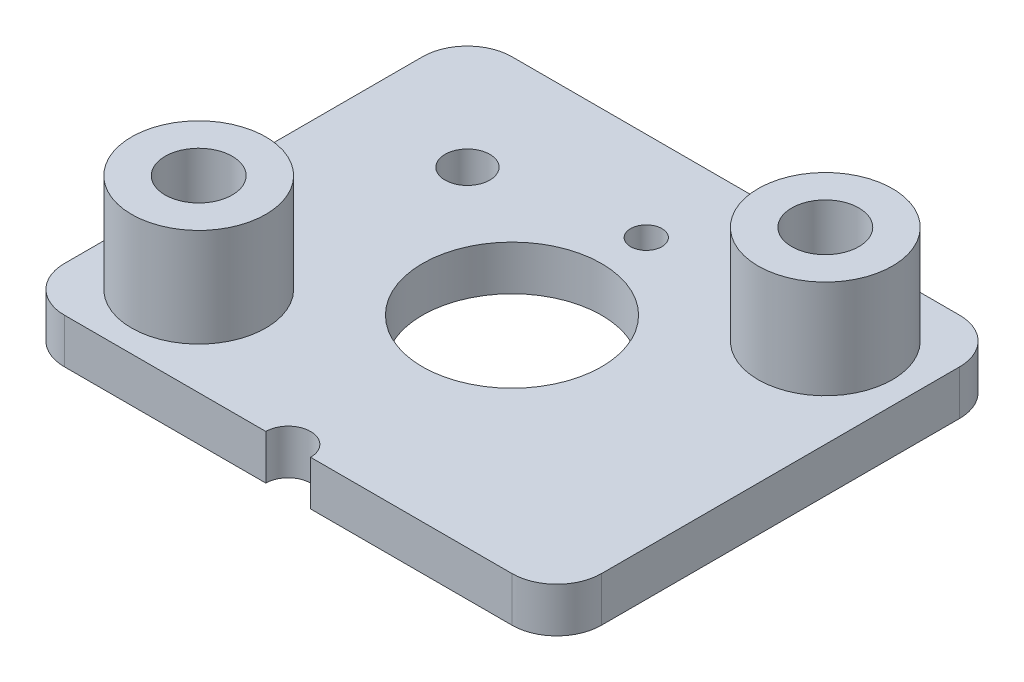
ISO-10303-21;
HEADER;
FILE_DESCRIPTION(('STEP AP214'),'2;1');
FILE_NAME('part.step','',(''),(''),'','','');
FILE_SCHEMA(('AUTOMOTIVE_DESIGN { 1 0 10303 214 1 1 1 1 }'));
ENDSEC;
DATA;
#1=APPLICATION_CONTEXT('core data for automotive mechanical design processes');
#2=APPLICATION_PROTOCOL_DEFINITION('international standard','automotive_design',2000,#1);
#3=PRODUCT_CONTEXT('',#1,'mechanical');
#4=PRODUCT('Part','Part','',(#3));
#5=PRODUCT_RELATED_PRODUCT_CATEGORY('part','',(#4));
#6=PRODUCT_DEFINITION_FORMATION('','',#4);
#7=PRODUCT_DEFINITION_CONTEXT('part definition',#1,'design');
#8=PRODUCT_DEFINITION('design','',#6,#7);
#9=PRODUCT_DEFINITION_SHAPE('','',#8);
#10=(LENGTH_UNIT() NAMED_UNIT(*) SI_UNIT(.MILLI.,.METRE.));
#11=(NAMED_UNIT(*) PLANE_ANGLE_UNIT() SI_UNIT($,.RADIAN.));
#12=(NAMED_UNIT(*) SI_UNIT($,.STERADIAN.) SOLID_ANGLE_UNIT());
#13=UNCERTAINTY_MEASURE_WITH_UNIT(LENGTH_MEASURE(1.E-05),#10,'distance_accuracy_value','');
#14=(GEOMETRIC_REPRESENTATION_CONTEXT(3) GLOBAL_UNCERTAINTY_ASSIGNED_CONTEXT((#13)) GLOBAL_UNIT_ASSIGNED_CONTEXT((#10,
#11,#12)) REPRESENTATION_CONTEXT('',''));
#15=CARTESIAN_POINT('',(0.,0.,0.));
#16=DIRECTION('',(0.,0.,1.));
#17=DIRECTION('',(1.,0.,0.));
#18=AXIS2_PLACEMENT_3D('',#15,#16,#17);
#19=CARTESIAN_POINT('',(-4.,3.2,3.));
#20=DIRECTION('',(0.,-1.,0.));
#21=DIRECTION('',(0.,0.,-1.));
#22=AXIS2_PLACEMENT_3D('',#19,#20,#21);
#23=CYLINDRICAL_SURFACE('',#22,1.5);
#24=CARTESIAN_POINT('',(-4.,3.2,3.));
#25=DIRECTION('',(0.,1.,0.));
#26=DIRECTION('',(0.,0.,1.));
#27=AXIS2_PLACEMENT_3D('',#24,#25,#26);
#28=CIRCLE('',#27,1.5);
#29=CARTESIAN_POINT('',(-4.,3.2,4.5));
#30=VERTEX_POINT('',#29);
#31=EDGE_CURVE('E11',#30,#30,#28,.T.);
#32=ORIENTED_EDGE('',*,*,#31,.F.);
#33=EDGE_LOOP('',(#32));
#34=FACE_BOUND('',#33,.T.);
#35=CARTESIAN_POINT('',(-4.,1.,3.));
#36=DIRECTION('',(0.,1.,0.));
#37=DIRECTION('',(0.,0.,1.));
#38=AXIS2_PLACEMENT_3D('',#35,#36,#37);
#39=CIRCLE('',#38,1.5);
#40=CARTESIAN_POINT('',(-4.,1.,4.5));
#41=VERTEX_POINT('',#40);
#42=EDGE_CURVE('E48',#41,#41,#39,.T.);
#43=ORIENTED_EDGE('',*,*,#42,.T.);
#44=EDGE_LOOP('',(#43));
#45=FACE_BOUND('',#44,.T.);
#46=ADVANCED_FACE('F45',(#34,#45),#23,.T.);
#47=CARTESIAN_POINT('',(-4.,3.2,3.));
#48=DIRECTION('',(0.,1.,0.));
#49=DIRECTION('',(0.,0.,1.));
#50=AXIS2_PLACEMENT_3D('',#47,#48,#49);
#51=PLANE('',#50);
#52=CARTESIAN_POINT('',(-4.,3.2,3.));
#53=DIRECTION('',(0.,1.,0.));
#54=DIRECTION('',(0.,0.,1.));
#55=AXIS2_PLACEMENT_3D('',#52,#53,#54);
#56=CIRCLE('',#55,0.75);
#57=CARTESIAN_POINT('',(-4.,3.2,3.75));
#58=VERTEX_POINT('',#57);
#59=EDGE_CURVE('E57',#58,#58,#56,.T.);
#60=ORIENTED_EDGE('',*,*,#59,.F.);
#61=EDGE_LOOP('',(#60));
#62=FACE_BOUND('',#61,.T.);
#63=ORIENTED_EDGE('',*,*,#31,.T.);
#64=EDGE_LOOP('',(#63));
#65=FACE_BOUND('',#64,.T.);
#66=ADVANCED_FACE('F72',(#62,#65),#51,.T.);
#67=CARTESIAN_POINT('',(-4.,1.,3.));
#68=DIRECTION('',(0.,1.,0.));
#69=DIRECTION('',(0.,0.,1.));
#70=AXIS2_PLACEMENT_3D('',#67,#68,#69);
#71=PLANE('',#70);
#72=CARTESIAN_POINT('',(-4.,1.,3.));
#73=DIRECTION('',(0.,1.,0.));
#74=DIRECTION('',(0.,0.,1.));
#75=AXIS2_PLACEMENT_3D('',#72,#73,#74);
#76=CIRCLE('',#75,0.75);
#77=CARTESIAN_POINT('',(-4.,1.,3.75));
#78=VERTEX_POINT('',#77);
#79=EDGE_CURVE('E55',#78,#78,#76,.T.);
#80=ORIENTED_EDGE('',*,*,#79,.T.);
#81=EDGE_LOOP('',(#80));
#82=FACE_BOUND('',#81,.T.);
#83=ORIENTED_EDGE('',*,*,#42,.F.);
#84=EDGE_LOOP('',(#83));
#85=FACE_BOUND('',#84,.T.);
#86=ADVANCED_FACE('F63',(#82,#85),#71,.F.);
#87=CARTESIAN_POINT('',(-4.,1.,3.));
#88=DIRECTION('',(0.,1.,0.));
#89=DIRECTION('',(0.,0.,1.));
#90=AXIS2_PLACEMENT_3D('',#87,#88,#89);
#91=CYLINDRICAL_SURFACE('',#90,0.75);
#92=ORIENTED_EDGE('',*,*,#79,.F.);
#93=EDGE_LOOP('',(#92));
#94=FACE_BOUND('',#93,.T.);
#95=ORIENTED_EDGE('',*,*,#59,.T.);
#96=EDGE_LOOP('',(#95));
#97=FACE_BOUND('',#96,.T.);
#98=ADVANCED_FACE('F66',(#94,#97),#91,.F.);
#99=CLOSED_SHELL('',(#46,#66,#86,#98));
#100=MANIFOLD_SOLID_BREP('B2',#99);
#101=CARTESIAN_POINT('',(4.,3.2,-3.));
#102=DIRECTION('',(0.,-1.,0.));
#103=DIRECTION('',(0.,0.,-1.));
#104=AXIS2_PLACEMENT_3D('',#101,#102,#103);
#105=CYLINDRICAL_SURFACE('',#104,1.5);
#106=CARTESIAN_POINT('',(4.,3.2,-3.));
#107=DIRECTION('',(0.,1.,0.));
#108=DIRECTION('',(0.,0.,1.));
#109=AXIS2_PLACEMENT_3D('',#106,#107,#108);
#110=CIRCLE('',#109,1.5);
#111=CARTESIAN_POINT('',(4.,3.2,-1.5));
#112=VERTEX_POINT('',#111);
#113=EDGE_CURVE('E44',#112,#112,#110,.T.);
#114=ORIENTED_EDGE('',*,*,#113,.F.);
#115=EDGE_LOOP('',(#114));
#116=FACE_BOUND('',#115,.T.);
#117=CARTESIAN_POINT('',(4.,1.,-3.));
#118=DIRECTION('',(0.,1.,0.));
#119=DIRECTION('',(0.,0.,1.));
#120=AXIS2_PLACEMENT_3D('',#117,#118,#119);
#121=CIRCLE('',#120,1.5);
#122=CARTESIAN_POINT('',(4.,1.,-1.5));
#123=VERTEX_POINT('',#122);
#124=EDGE_CURVE('E118',#123,#123,#121,.T.);
#125=ORIENTED_EDGE('',*,*,#124,.T.);
#126=EDGE_LOOP('',(#125));
#127=FACE_BOUND('',#126,.T.);
#128=ADVANCED_FACE('F115',(#116,#127),#105,.T.);
#129=CARTESIAN_POINT('',(4.,3.2,-3.));
#130=DIRECTION('',(0.,1.,0.));
#131=DIRECTION('',(0.,0.,1.));
#132=AXIS2_PLACEMENT_3D('',#129,#130,#131);
#133=PLANE('',#132);
#134=CARTESIAN_POINT('',(4.,3.2,-3.));
#135=DIRECTION('',(0.,1.,0.));
#136=DIRECTION('',(0.,0.,1.));
#137=AXIS2_PLACEMENT_3D('',#134,#135,#136);
#138=CIRCLE('',#137,0.75);
#139=CARTESIAN_POINT('',(4.,3.2,-2.25));
#140=VERTEX_POINT('',#139);
#141=EDGE_CURVE('E127',#140,#140,#138,.T.);
#142=ORIENTED_EDGE('',*,*,#141,.F.);
#143=EDGE_LOOP('',(#142));
#144=FACE_BOUND('',#143,.T.);
#145=ORIENTED_EDGE('',*,*,#113,.T.);
#146=EDGE_LOOP('',(#145));
#147=FACE_BOUND('',#146,.T.);
#148=ADVANCED_FACE('F142',(#144,#147),#133,.T.);
#149=CARTESIAN_POINT('',(4.,1.,-3.));
#150=DIRECTION('',(0.,1.,0.));
#151=DIRECTION('',(0.,0.,1.));
#152=AXIS2_PLACEMENT_3D('',#149,#150,#151);
#153=PLANE('',#152);
#154=CARTESIAN_POINT('',(4.,1.,-3.));
#155=DIRECTION('',(0.,1.,0.));
#156=DIRECTION('',(0.,0.,1.));
#157=AXIS2_PLACEMENT_3D('',#154,#155,#156);
#158=CIRCLE('',#157,0.75);
#159=CARTESIAN_POINT('',(4.,1.,-2.25));
#160=VERTEX_POINT('',#159);
#161=EDGE_CURVE('E125',#160,#160,#158,.T.);
#162=ORIENTED_EDGE('',*,*,#161,.T.);
#163=EDGE_LOOP('',(#162));
#164=FACE_BOUND('',#163,.T.);
#165=ORIENTED_EDGE('',*,*,#124,.F.);
#166=EDGE_LOOP('',(#165));
#167=FACE_BOUND('',#166,.T.);
#168=ADVANCED_FACE('F133',(#164,#167),#153,.F.);
#169=CARTESIAN_POINT('',(4.,1.,-3.));
#170=DIRECTION('',(0.,1.,0.));
#171=DIRECTION('',(0.,0.,1.));
#172=AXIS2_PLACEMENT_3D('',#169,#170,#171);
#173=CYLINDRICAL_SURFACE('',#172,0.75);
#174=ORIENTED_EDGE('',*,*,#161,.F.);
#175=EDGE_LOOP('',(#174));
#176=FACE_BOUND('',#175,.T.);
#177=ORIENTED_EDGE('',*,*,#141,.T.);
#178=EDGE_LOOP('',(#177));
#179=FACE_BOUND('',#178,.T.);
#180=ADVANCED_FACE('F136',(#176,#179),#173,.F.);
#181=CLOSED_SHELL('',(#128,#148,#168,#180));
#182=MANIFOLD_SOLID_BREP('B6',#181);
#183=CARTESIAN_POINT('',(0.,1.,5.));
#184=DIRECTION('',(0.,-1.,0.));
#185=DIRECTION('',(0.,0.,-1.));
#186=AXIS2_PLACEMENT_3D('',#183,#184,#185);
#187=PLANE('',#186);
#188=DIRECTION('',(0.,0.,1.));
#189=VECTOR('',#188,1.);
#190=CARTESIAN_POINT('',(-6.,1.,-5.));
#191=LINE('',#190,#189);
#192=CARTESIAN_POINT('',(-6.,1.,-4.));
#193=VERTEX_POINT('',#192);
#194=CARTESIAN_POINT('',(-6.,1.,4.));
#195=VERTEX_POINT('',#194);
#196=EDGE_CURVE('E265',#193,#195,#191,.T.);
#197=ORIENTED_EDGE('',*,*,#196,.T.);
#198=CARTESIAN_POINT('',(-5.,1.,4.));
#199=DIRECTION('',(0.,-1.,0.));
#200=DIRECTION('',(0.,0.,-1.));
#201=AXIS2_PLACEMENT_3D('',#198,#199,#200);
#202=CIRCLE('',#201,1.);
#203=CARTESIAN_POINT('',(-5.,1.,5.));
#204=VERTEX_POINT('',#203);
#205=EDGE_CURVE('E261',#195,#204,#202,.F.);
#206=ORIENTED_EDGE('',*,*,#205,.T.);
#207=DIRECTION('',(1.,0.,0.));
#208=VECTOR('',#207,1.);
#209=CARTESIAN_POINT('',(-6.,1.,5.));
#210=LINE('',#209,#208);
#211=CARTESIAN_POINT('',(-0.499999999999999,1.,5.));
#212=VERTEX_POINT('',#211);
#213=EDGE_CURVE('E252',#204,#212,#210,.T.);
#214=ORIENTED_EDGE('',*,*,#213,.T.);
#215=CARTESIAN_POINT('',(0.,1.,5.));
#216=DIRECTION('',(0.,-1.,0.));
#217=DIRECTION('',(0.,0.,-1.));
#218=AXIS2_PLACEMENT_3D('',#215,#216,#217);
#219=CIRCLE('',#218,0.5);
#220=CARTESIAN_POINT('',(0.5,1.,5.));
#221=VERTEX_POINT('',#220);
#222=EDGE_CURVE('E258',#212,#221,#219,.T.);
#223=ORIENTED_EDGE('',*,*,#222,.T.);
#224=DIRECTION('',(1.,0.,0.));
#225=VECTOR('',#224,1.);
#226=CARTESIAN_POINT('',(0.5,1.,5.));
#227=LINE('',#226,#225);
#228=CARTESIAN_POINT('',(5.,1.,5.));
#229=VERTEX_POINT('',#228);
#230=EDGE_CURVE('E298',#221,#229,#227,.T.);
#231=ORIENTED_EDGE('',*,*,#230,.T.);
#232=CARTESIAN_POINT('',(5.,1.,4.));
#233=DIRECTION('',(0.,-1.,0.));
#234=DIRECTION('',(0.,0.,-1.));
#235=AXIS2_PLACEMENT_3D('',#232,#233,#234);
#236=CIRCLE('',#235,1.);
#237=CARTESIAN_POINT('',(6.,1.,4.));
#238=VERTEX_POINT('',#237);
#239=EDGE_CURVE('E314',#229,#238,#236,.F.);
#240=ORIENTED_EDGE('',*,*,#239,.T.);
#241=DIRECTION('',(0.,0.,-1.));
#242=VECTOR('',#241,1.);
#243=CARTESIAN_POINT('',(6.,1.,-5.));
#244=LINE('',#243,#242);
#245=CARTESIAN_POINT('',(6.,1.,-4.));
#246=VERTEX_POINT('',#245);
#247=EDGE_CURVE('E330',#238,#246,#244,.T.);
#248=ORIENTED_EDGE('',*,*,#247,.T.);
#249=CARTESIAN_POINT('',(5.,1.,-4.));
#250=DIRECTION('',(0.,-1.,0.));
#251=DIRECTION('',(0.,0.,-1.));
#252=AXIS2_PLACEMENT_3D('',#249,#250,#251);
#253=CIRCLE('',#252,1.);
#254=CARTESIAN_POINT('',(5.,1.,-5.));
#255=VERTEX_POINT('',#254);
#256=EDGE_CURVE('E198',#246,#255,#253,.F.);
#257=ORIENTED_EDGE('',*,*,#256,.T.);
#258=DIRECTION('',(-1.,0.,0.));
#259=VECTOR('',#258,1.);
#260=CARTESIAN_POINT('',(-6.,1.,-5.));
#261=LINE('',#260,#259);
#262=CARTESIAN_POINT('',(-5.,1.,-5.));
#263=VERTEX_POINT('',#262);
#264=EDGE_CURVE('E335',#255,#263,#261,.T.);
#265=ORIENTED_EDGE('',*,*,#264,.T.);
#266=CARTESIAN_POINT('',(-5.,1.,-4.));
#267=DIRECTION('',(0.,-1.,0.));
#268=DIRECTION('',(0.,0.,-1.));
#269=AXIS2_PLACEMENT_3D('',#266,#267,#268);
#270=CIRCLE('',#269,1.);
#271=EDGE_CURVE('E316',#263,#193,#270,.F.);
#272=ORIENTED_EDGE('',*,*,#271,.T.);
#273=EDGE_LOOP('',(#197,#206,#214,#223,#231,#240,#248,#257,#265,#272));
#274=FACE_BOUND('',#273,.T.);
#275=CARTESIAN_POINT('',(0.,1.,0.));
#276=DIRECTION('',(0.,1.,0.));
#277=DIRECTION('',(0.,0.,1.));
#278=AXIS2_PLACEMENT_3D('',#275,#276,#277);
#279=CIRCLE('',#278,2.);
#280=CARTESIAN_POINT('',(0.,1.,2.));
#281=VERTEX_POINT('',#280);
#282=EDGE_CURVE('E288',#281,#281,#279,.T.);
#283=ORIENTED_EDGE('',*,*,#282,.F.);
#284=EDGE_LOOP('',(#283));
#285=FACE_BOUND('',#284,.T.);
#286=CARTESIAN_POINT('',(4.,1.,-3.));
#287=DIRECTION('',(0.,1.,0.));
#288=DIRECTION('',(0.,0.,1.));
#289=AXIS2_PLACEMENT_3D('',#286,#287,#288);
#290=CIRCLE('',#289,1.5);
#291=CARTESIAN_POINT('',(4.,1.,-1.5));
#292=VERTEX_POINT('',#291);
#293=EDGE_CURVE('E359',#292,#292,#290,.T.);
#294=ORIENTED_EDGE('',*,*,#293,.F.);
#295=EDGE_LOOP('',(#294));
#296=FACE_BOUND('',#295,.T.);
#297=CARTESIAN_POINT('',(0.,1.,-3.));
#298=DIRECTION('',(0.,1.,0.));
#299=DIRECTION('',(0.,0.,1.));
#300=AXIS2_PLACEMENT_3D('',#297,#298,#299);
#301=CIRCLE('',#300,0.35);
#302=CARTESIAN_POINT('',(0.,1.,-2.65));
#303=VERTEX_POINT('',#302);
#304=EDGE_CURVE('E365',#303,#303,#301,.T.);
#305=ORIENTED_EDGE('',*,*,#304,.F.);
#306=EDGE_LOOP('',(#305));
#307=FACE_BOUND('',#306,.T.);
#308=CARTESIAN_POINT('',(-4.,1.,3.));
#309=DIRECTION('',(0.,1.,0.));
#310=DIRECTION('',(0.,0.,1.));
#311=AXIS2_PLACEMENT_3D('',#308,#309,#310);
#312=CIRCLE('',#311,1.5);
#313=CARTESIAN_POINT('',(-4.,1.,4.5));
#314=VERTEX_POINT('',#313);
#315=EDGE_CURVE('E371',#314,#314,#312,.T.);
#316=ORIENTED_EDGE('',*,*,#315,.F.);
#317=EDGE_LOOP('',(#316));
#318=FACE_BOUND('',#317,.T.);
#319=CARTESIAN_POINT('',(-3.3605974754568,1.,-2.36490838925265));
#320=DIRECTION('',(0.,1.,0.));
#321=DIRECTION('',(0.,0.,1.));
#322=AXIS2_PLACEMENT_3D('',#319,#320,#321);
#323=CIRCLE('',#322,0.5);
#324=CARTESIAN_POINT('',(-3.3605974754568,1.,-1.86490838925265));
#325=VERTEX_POINT('',#324);
#326=EDGE_CURVE('E377',#325,#325,#323,.T.);
#327=ORIENTED_EDGE('',*,*,#326,.F.);
#328=EDGE_LOOP('',(#327));
#329=FACE_BOUND('',#328,.T.);
#330=ADVANCED_FACE('F176',(#274,#285,#296,#307,#318,#329),#187,.F.);
#331=CARTESIAN_POINT('',(0.,0.,5.));
#332=DIRECTION('',(0.,-1.,0.));
#333=DIRECTION('',(0.,0.,-1.));
#334=AXIS2_PLACEMENT_3D('',#331,#332,#333);
#335=PLANE('',#334);
#336=CARTESIAN_POINT('',(-4.,0.,3.));
#337=DIRECTION('',(0.,1.,0.));
#338=DIRECTION('',(0.,0.,1.));
#339=AXIS2_PLACEMENT_3D('',#336,#337,#338);
#340=CIRCLE('',#339,1.5);
#341=CARTESIAN_POINT('',(-4.,0.,4.5));
#342=VERTEX_POINT('',#341);
#343=EDGE_CURVE('E374',#342,#342,#340,.T.);
#344=ORIENTED_EDGE('',*,*,#343,.T.);
#345=EDGE_LOOP('',(#344));
#346=FACE_BOUND('',#345,.T.);
#347=CARTESIAN_POINT('',(4.,0.,-3.));
#348=DIRECTION('',(0.,1.,0.));
#349=DIRECTION('',(0.,0.,1.));
#350=AXIS2_PLACEMENT_3D('',#347,#348,#349);
#351=CIRCLE('',#350,1.5);
#352=CARTESIAN_POINT('',(4.,0.,-1.5));
#353=VERTEX_POINT('',#352);
#354=EDGE_CURVE('E362',#353,#353,#351,.T.);
#355=ORIENTED_EDGE('',*,*,#354,.T.);
#356=EDGE_LOOP('',(#355));
#357=FACE_BOUND('',#356,.T.);
#358=DIRECTION('',(1.,0.,0.));
#359=VECTOR('',#358,1.);
#360=CARTESIAN_POINT('',(-6.,0.,5.));
#361=LINE('',#360,#359);
#362=CARTESIAN_POINT('',(-5.,0.,5.));
#363=VERTEX_POINT('',#362);
#364=CARTESIAN_POINT('',(-0.499999999999999,0.,5.));
#365=VERTEX_POINT('',#364);
#366=EDGE_CURVE('E271',#363,#365,#361,.T.);
#367=ORIENTED_EDGE('',*,*,#366,.F.);
#368=CARTESIAN_POINT('',(-5.,0.,4.));
#369=DIRECTION('',(0.,-1.,0.));
#370=DIRECTION('',(0.,0.,-1.));
#371=AXIS2_PLACEMENT_3D('',#368,#369,#370);
#372=CIRCLE('',#371,1.);
#373=CARTESIAN_POINT('',(-6.,0.,4.));
#374=VERTEX_POINT('',#373);
#375=EDGE_CURVE('E307',#363,#374,#372,.T.);
#376=ORIENTED_EDGE('',*,*,#375,.T.);
#377=DIRECTION('',(0.,0.,1.));
#378=VECTOR('',#377,1.);
#379=CARTESIAN_POINT('',(-6.,0.,-5.));
#380=LINE('',#379,#378);
#381=CARTESIAN_POINT('',(-6.,0.,-4.));
#382=VERTEX_POINT('',#381);
#383=EDGE_CURVE('E293',#382,#374,#380,.T.);
#384=ORIENTED_EDGE('',*,*,#383,.F.);
#385=CARTESIAN_POINT('',(-5.,0.,-4.));
#386=DIRECTION('',(0.,-1.,0.));
#387=DIRECTION('',(0.,0.,-1.));
#388=AXIS2_PLACEMENT_3D('',#385,#386,#387);
#389=CIRCLE('',#388,1.);
#390=CARTESIAN_POINT('',(-5.,0.,-5.));
#391=VERTEX_POINT('',#390);
#392=EDGE_CURVE('E303',#382,#391,#389,.T.);
#393=ORIENTED_EDGE('',*,*,#392,.T.);
#394=DIRECTION('',(-1.,0.,0.));
#395=VECTOR('',#394,1.);
#396=CARTESIAN_POINT('',(-6.,0.,-5.));
#397=LINE('',#396,#395);
#398=CARTESIAN_POINT('',(5.,0.,-5.));
#399=VERTEX_POINT('',#398);
#400=EDGE_CURVE('E291',#399,#391,#397,.T.);
#401=ORIENTED_EDGE('',*,*,#400,.F.);
#402=CARTESIAN_POINT('',(5.,0.,-4.));
#403=DIRECTION('',(0.,-1.,0.));
#404=DIRECTION('',(0.,0.,-1.));
#405=AXIS2_PLACEMENT_3D('',#402,#403,#404);
#406=CIRCLE('',#405,1.);
#407=CARTESIAN_POINT('',(6.,0.,-4.));
#408=VERTEX_POINT('',#407);
#409=EDGE_CURVE('E305',#399,#408,#406,.T.);
#410=ORIENTED_EDGE('',*,*,#409,.T.);
#411=DIRECTION('',(0.,0.,-1.));
#412=VECTOR('',#411,1.);
#413=CARTESIAN_POINT('',(6.,0.,-5.));
#414=LINE('',#413,#412);
#415=CARTESIAN_POINT('',(6.,0.,4.));
#416=VERTEX_POINT('',#415);
#417=EDGE_CURVE('E287',#416,#408,#414,.T.);
#418=ORIENTED_EDGE('',*,*,#417,.F.);
#419=CARTESIAN_POINT('',(5.,0.,4.));
#420=DIRECTION('',(0.,-1.,0.));
#421=DIRECTION('',(0.,0.,-1.));
#422=AXIS2_PLACEMENT_3D('',#419,#420,#421);
#423=CIRCLE('',#422,1.);
#424=CARTESIAN_POINT('',(5.,0.,5.));
#425=VERTEX_POINT('',#424);
#426=EDGE_CURVE('E301',#416,#425,#423,.T.);
#427=ORIENTED_EDGE('',*,*,#426,.T.);
#428=DIRECTION('',(1.,0.,0.));
#429=VECTOR('',#428,1.);
#430=CARTESIAN_POINT('',(0.5,0.,5.));
#431=LINE('',#430,#429);
#432=CARTESIAN_POINT('',(0.5,0.,5.));
#433=VERTEX_POINT('',#432);
#434=EDGE_CURVE('E284',#433,#425,#431,.T.);
#435=ORIENTED_EDGE('',*,*,#434,.F.);
#436=CARTESIAN_POINT('',(0.,0.,5.));
#437=DIRECTION('',(0.,-1.,0.));
#438=DIRECTION('',(0.,0.,-1.));
#439=AXIS2_PLACEMENT_3D('',#436,#437,#438);
#440=CIRCLE('',#439,0.5);
#441=EDGE_CURVE('E297',#365,#433,#440,.T.);
#442=ORIENTED_EDGE('',*,*,#441,.F.);
#443=EDGE_LOOP('',(#367,#376,#384,#393,#401,#410,#418,#427,#435,#442));
#444=FACE_BOUND('',#443,.T.);
#445=CARTESIAN_POINT('',(0.,0.,0.));
#446=DIRECTION('',(0.,1.,0.));
#447=DIRECTION('',(0.,0.,1.));
#448=AXIS2_PLACEMENT_3D('',#445,#446,#447);
#449=CIRCLE('',#448,2.);
#450=CARTESIAN_POINT('',(0.,0.,2.));
#451=VERTEX_POINT('',#450);
#452=EDGE_CURVE('E356',#451,#451,#449,.T.);
#453=ORIENTED_EDGE('',*,*,#452,.T.);
#454=EDGE_LOOP('',(#453));
#455=FACE_BOUND('',#454,.T.);
#456=CARTESIAN_POINT('',(0.,0.,-3.));
#457=DIRECTION('',(0.,1.,0.));
#458=DIRECTION('',(0.,0.,1.));
#459=AXIS2_PLACEMENT_3D('',#456,#457,#458);
#460=CIRCLE('',#459,0.35);
#461=CARTESIAN_POINT('',(0.,0.,-2.65));
#462=VERTEX_POINT('',#461);
#463=EDGE_CURVE('E368',#462,#462,#460,.T.);
#464=ORIENTED_EDGE('',*,*,#463,.T.);
#465=EDGE_LOOP('',(#464));
#466=FACE_BOUND('',#465,.T.);
#467=CARTESIAN_POINT('',(-3.3605974754568,0.,-2.36490838925265));
#468=DIRECTION('',(0.,1.,0.));
#469=DIRECTION('',(0.,0.,1.));
#470=AXIS2_PLACEMENT_3D('',#467,#468,#469);
#471=CIRCLE('',#470,0.5);
#472=CARTESIAN_POINT('',(-3.3605974754568,0.,-1.86490838925265));
#473=VERTEX_POINT('',#472);
#474=EDGE_CURVE('E380',#473,#473,#471,.T.);
#475=ORIENTED_EDGE('',*,*,#474,.T.);
#476=EDGE_LOOP('',(#475));
#477=FACE_BOUND('',#476,.T.);
#478=ADVANCED_FACE('F342',(#346,#357,#444,#455,#466,#477),#335,.T.);
#479=CARTESIAN_POINT('',(0.5,1.,5.));
#480=DIRECTION('',(0.,0.,-1.));
#481=DIRECTION('',(-1.,0.,0.));
#482=AXIS2_PLACEMENT_3D('',#479,#480,#481);
#483=PLANE('',#482);
#484=ORIENTED_EDGE('',*,*,#434,.T.);
#485=DIRECTION('',(0.,-1.,0.));
#486=VECTOR('',#485,1.);
#487=CARTESIAN_POINT('',(5.,1.,5.));
#488=LINE('',#487,#486);
#489=EDGE_CURVE('E113',#425,#229,#488,.F.);
#490=ORIENTED_EDGE('',*,*,#489,.T.);
#491=ORIENTED_EDGE('',*,*,#230,.F.);
#492=DIRECTION('',(0.,-1.,0.));
#493=VECTOR('',#492,1.);
#494=CARTESIAN_POINT('',(0.5,1.,5.));
#495=LINE('',#494,#493);
#496=EDGE_CURVE('E275',#221,#433,#495,.T.);
#497=ORIENTED_EDGE('',*,*,#496,.T.);
#498=EDGE_LOOP('',(#484,#490,#491,#497));
#499=FACE_BOUND('',#498,.T.);
#500=ADVANCED_FACE('F394',(#499),#483,.F.);
#501=CARTESIAN_POINT('',(6.,1.,-5.));
#502=DIRECTION('',(-1.,0.,0.));
#503=DIRECTION('',(0.,0.,1.));
#504=AXIS2_PLACEMENT_3D('',#501,#502,#503);
#505=PLANE('',#504);
#506=ORIENTED_EDGE('',*,*,#417,.T.);
#507=DIRECTION('',(0.,-1.,0.));
#508=VECTOR('',#507,1.);
#509=CARTESIAN_POINT('',(6.,1.,-4.));
#510=LINE('',#509,#508);
#511=EDGE_CURVE('E184',#408,#246,#510,.F.);
#512=ORIENTED_EDGE('',*,*,#511,.T.);
#513=ORIENTED_EDGE('',*,*,#247,.F.);
#514=DIRECTION('',(0.,-1.,0.));
#515=VECTOR('',#514,1.);
#516=CARTESIAN_POINT('',(6.,1.,4.));
#517=LINE('',#516,#515);
#518=EDGE_CURVE('E324',#238,#416,#517,.T.);
#519=ORIENTED_EDGE('',*,*,#518,.T.);
#520=EDGE_LOOP('',(#506,#512,#513,#519));
#521=FACE_BOUND('',#520,.T.);
#522=ADVANCED_FACE('F329',(#521),#505,.F.);
#523=CARTESIAN_POINT('',(-6.,1.,-5.));
#524=DIRECTION('',(0.,0.,1.));
#525=DIRECTION('',(1.,0.,0.));
#526=AXIS2_PLACEMENT_3D('',#523,#524,#525);
#527=PLANE('',#526);
#528=ORIENTED_EDGE('',*,*,#264,.F.);
#529=DIRECTION('',(0.,-1.,0.));
#530=VECTOR('',#529,1.);
#531=CARTESIAN_POINT('',(5.,1.,-5.));
#532=LINE('',#531,#530);
#533=EDGE_CURVE('E321',#255,#399,#532,.T.);
#534=ORIENTED_EDGE('',*,*,#533,.T.);
#535=ORIENTED_EDGE('',*,*,#400,.T.);
#536=DIRECTION('',(0.,-1.,0.));
#537=VECTOR('',#536,1.);
#538=CARTESIAN_POINT('',(-5.,1.,-5.));
#539=LINE('',#538,#537);
#540=EDGE_CURVE('E191',#391,#263,#539,.F.);
#541=ORIENTED_EDGE('',*,*,#540,.T.);
#542=EDGE_LOOP('',(#528,#534,#535,#541));
#543=FACE_BOUND('',#542,.T.);
#544=ADVANCED_FACE('F340',(#543),#527,.F.);
#545=CARTESIAN_POINT('',(-6.,1.,-5.));
#546=DIRECTION('',(1.,0.,0.));
#547=DIRECTION('',(0.,0.,-1.));
#548=AXIS2_PLACEMENT_3D('',#545,#546,#547);
#549=PLANE('',#548);
#550=ORIENTED_EDGE('',*,*,#383,.T.);
#551=DIRECTION('',(0.,-1.,0.));
#552=VECTOR('',#551,1.);
#553=CARTESIAN_POINT('',(-6.,1.,4.));
#554=LINE('',#553,#552);
#555=EDGE_CURVE('E312',#374,#195,#554,.F.);
#556=ORIENTED_EDGE('',*,*,#555,.T.);
#557=ORIENTED_EDGE('',*,*,#196,.F.);
#558=DIRECTION('',(0.,-1.,0.));
#559=VECTOR('',#558,1.);
#560=CARTESIAN_POINT('',(-6.,1.,-4.));
#561=LINE('',#560,#559);
#562=EDGE_CURVE('E309',#193,#382,#561,.T.);
#563=ORIENTED_EDGE('',*,*,#562,.T.);
#564=EDGE_LOOP('',(#550,#556,#557,#563));
#565=FACE_BOUND('',#564,.T.);
#566=ADVANCED_FACE('F351',(#565),#549,.F.);
#567=CARTESIAN_POINT('',(-6.,1.,5.));
#568=DIRECTION('',(0.,0.,-1.));
#569=DIRECTION('',(-1.,0.,0.));
#570=AXIS2_PLACEMENT_3D('',#567,#568,#569);
#571=PLANE('',#570);
#572=ORIENTED_EDGE('',*,*,#213,.F.);
#573=DIRECTION('',(0.,-1.,0.));
#574=VECTOR('',#573,1.);
#575=CARTESIAN_POINT('',(-5.,1.,5.));
#576=LINE('',#575,#574);
#577=EDGE_CURVE('E274',#204,#363,#576,.T.);
#578=ORIENTED_EDGE('',*,*,#577,.T.);
#579=ORIENTED_EDGE('',*,*,#366,.T.);
#580=DIRECTION('',(0.,-1.,0.));
#581=VECTOR('',#580,1.);
#582=CARTESIAN_POINT('',(-0.499999999999999,1.,5.));
#583=LINE('',#582,#581);
#584=EDGE_CURVE('E268',#212,#365,#583,.T.);
#585=ORIENTED_EDGE('',*,*,#584,.F.);
#586=EDGE_LOOP('',(#572,#578,#579,#585));
#587=FACE_BOUND('',#586,.T.);
#588=ADVANCED_FACE('F269',(#587),#571,.F.);
#589=CARTESIAN_POINT('',(0.,1.,5.));
#590=DIRECTION('',(0.,-1.,0.));
#591=DIRECTION('',(0.,0.,-1.));
#592=AXIS2_PLACEMENT_3D('',#589,#590,#591);
#593=CYLINDRICAL_SURFACE('',#592,0.5);
#594=ORIENTED_EDGE('',*,*,#441,.T.);
#595=ORIENTED_EDGE('',*,*,#496,.F.);
#596=ORIENTED_EDGE('',*,*,#222,.F.);
#597=ORIENTED_EDGE('',*,*,#584,.T.);
#598=EDGE_LOOP('',(#594,#595,#596,#597));
#599=FACE_BOUND('',#598,.T.);
#600=ADVANCED_FACE('F277',(#599),#593,.F.);
#601=CARTESIAN_POINT('',(0.,1.,0.));
#602=DIRECTION('',(0.,-1.,0.));
#603=DIRECTION('',(0.,0.,-1.));
#604=AXIS2_PLACEMENT_3D('',#601,#602,#603);
#605=CYLINDRICAL_SURFACE('',#604,2.);
#606=ORIENTED_EDGE('',*,*,#282,.T.);
#607=EDGE_LOOP('',(#606));
#608=FACE_BOUND('',#607,.T.);
#609=ORIENTED_EDGE('',*,*,#452,.F.);
#610=EDGE_LOOP('',(#609));
#611=FACE_BOUND('',#610,.T.);
#612=ADVANCED_FACE('F398',(#608,#611),#605,.F.);
#613=CARTESIAN_POINT('',(4.,1.,-3.));
#614=DIRECTION('',(0.,-1.,0.));
#615=DIRECTION('',(0.,0.,-1.));
#616=AXIS2_PLACEMENT_3D('',#613,#614,#615);
#617=CYLINDRICAL_SURFACE('',#616,1.5);
#618=ORIENTED_EDGE('',*,*,#293,.T.);
#619=EDGE_LOOP('',(#618));
#620=FACE_BOUND('',#619,.T.);
#621=ORIENTED_EDGE('',*,*,#354,.F.);
#622=EDGE_LOOP('',(#621));
#623=FACE_BOUND('',#622,.T.);
#624=ADVANCED_FACE('F513',(#620,#623),#617,.F.);
#625=CARTESIAN_POINT('',(0.,1.,-3.));
#626=DIRECTION('',(0.,-1.,0.));
#627=DIRECTION('',(0.,0.,-1.));
#628=AXIS2_PLACEMENT_3D('',#625,#626,#627);
#629=CYLINDRICAL_SURFACE('',#628,0.35);
#630=ORIENTED_EDGE('',*,*,#304,.T.);
#631=EDGE_LOOP('',(#630));
#632=FACE_BOUND('',#631,.T.);
#633=ORIENTED_EDGE('',*,*,#463,.F.);
#634=EDGE_LOOP('',(#633));
#635=FACE_BOUND('',#634,.T.);
#636=ADVANCED_FACE('F503',(#632,#635),#629,.F.);
#637=CARTESIAN_POINT('',(-4.,1.,3.));
#638=DIRECTION('',(0.,-1.,0.));
#639=DIRECTION('',(0.,0.,-1.));
#640=AXIS2_PLACEMENT_3D('',#637,#638,#639);
#641=CYLINDRICAL_SURFACE('',#640,1.5);
#642=ORIENTED_EDGE('',*,*,#315,.T.);
#643=EDGE_LOOP('',(#642));
#644=FACE_BOUND('',#643,.T.);
#645=ORIENTED_EDGE('',*,*,#343,.F.);
#646=EDGE_LOOP('',(#645));
#647=FACE_BOUND('',#646,.T.);
#648=ADVANCED_FACE('F494',(#644,#647),#641,.F.);
#649=CARTESIAN_POINT('',(-3.3605974754568,1.,-2.36490838925265));
#650=DIRECTION('',(0.,-1.,0.));
#651=DIRECTION('',(0.,0.,-1.));
#652=AXIS2_PLACEMENT_3D('',#649,#650,#651);
#653=CYLINDRICAL_SURFACE('',#652,0.5);
#654=ORIENTED_EDGE('',*,*,#326,.T.);
#655=EDGE_LOOP('',(#654));
#656=FACE_BOUND('',#655,.T.);
#657=ORIENTED_EDGE('',*,*,#474,.F.);
#658=EDGE_LOOP('',(#657));
#659=FACE_BOUND('',#658,.T.);
#660=ADVANCED_FACE('F386',(#656,#659),#653,.F.);
#661=CARTESIAN_POINT('',(-5.,1.,4.));
#662=DIRECTION('',(0.,-1.,0.));
#663=DIRECTION('',(0.,0.,-1.));
#664=AXIS2_PLACEMENT_3D('',#661,#662,#663);
#665=CYLINDRICAL_SURFACE('',#664,1.);
#666=ORIENTED_EDGE('',*,*,#205,.F.);
#667=ORIENTED_EDGE('',*,*,#555,.F.);
#668=ORIENTED_EDGE('',*,*,#375,.F.);
#669=ORIENTED_EDGE('',*,*,#577,.F.);
#670=EDGE_LOOP('',(#666,#667,#668,#669));
#671=FACE_BOUND('',#670,.T.);
#672=ADVANCED_FACE('F414',(#671),#665,.T.);
#673=CARTESIAN_POINT('',(5.,1.,-4.));
#674=DIRECTION('',(0.,-1.,0.));
#675=DIRECTION('',(0.,0.,-1.));
#676=AXIS2_PLACEMENT_3D('',#673,#674,#675);
#677=CYLINDRICAL_SURFACE('',#676,1.);
#678=ORIENTED_EDGE('',*,*,#256,.F.);
#679=ORIENTED_EDGE('',*,*,#511,.F.);
#680=ORIENTED_EDGE('',*,*,#409,.F.);
#681=ORIENTED_EDGE('',*,*,#533,.F.);
#682=EDGE_LOOP('',(#678,#679,#680,#681));
#683=FACE_BOUND('',#682,.T.);
#684=ADVANCED_FACE('F338',(#683),#677,.T.);
#685=CARTESIAN_POINT('',(-5.,1.,-4.));
#686=DIRECTION('',(0.,-1.,0.));
#687=DIRECTION('',(0.,0.,-1.));
#688=AXIS2_PLACEMENT_3D('',#685,#686,#687);
#689=CYLINDRICAL_SURFACE('',#688,1.);
#690=ORIENTED_EDGE('',*,*,#271,.F.);
#691=ORIENTED_EDGE('',*,*,#540,.F.);
#692=ORIENTED_EDGE('',*,*,#392,.F.);
#693=ORIENTED_EDGE('',*,*,#562,.F.);
#694=EDGE_LOOP('',(#690,#691,#692,#693));
#695=FACE_BOUND('',#694,.T.);
#696=ADVANCED_FACE('F348',(#695),#689,.T.);
#697=CARTESIAN_POINT('',(5.,1.,4.));
#698=DIRECTION('',(0.,-1.,0.));
#699=DIRECTION('',(0.,0.,-1.));
#700=AXIS2_PLACEMENT_3D('',#697,#698,#699);
#701=CYLINDRICAL_SURFACE('',#700,1.);
#702=ORIENTED_EDGE('',*,*,#239,.F.);
#703=ORIENTED_EDGE('',*,*,#489,.F.);
#704=ORIENTED_EDGE('',*,*,#426,.F.);
#705=ORIENTED_EDGE('',*,*,#518,.F.);
#706=EDGE_LOOP('',(#702,#703,#704,#705));
#707=FACE_BOUND('',#706,.T.);
#708=ADVANCED_FACE('F178',(#707),#701,.T.);
#709=CLOSED_SHELL('',(#330,#478,#500,#522,#544,#566,#588,#600,#612,#624,#636,#648,#660,#672,
#684,#696,#708));
#710=MANIFOLD_SOLID_BREP('B39',#709);
#711=ADVANCED_BREP_SHAPE_REPRESENTATION('',(#18,#100,#182,#710),#14);
#712=SHAPE_DEFINITION_REPRESENTATION(#9,#711);
ENDSEC;
END-ISO-10303-21;
